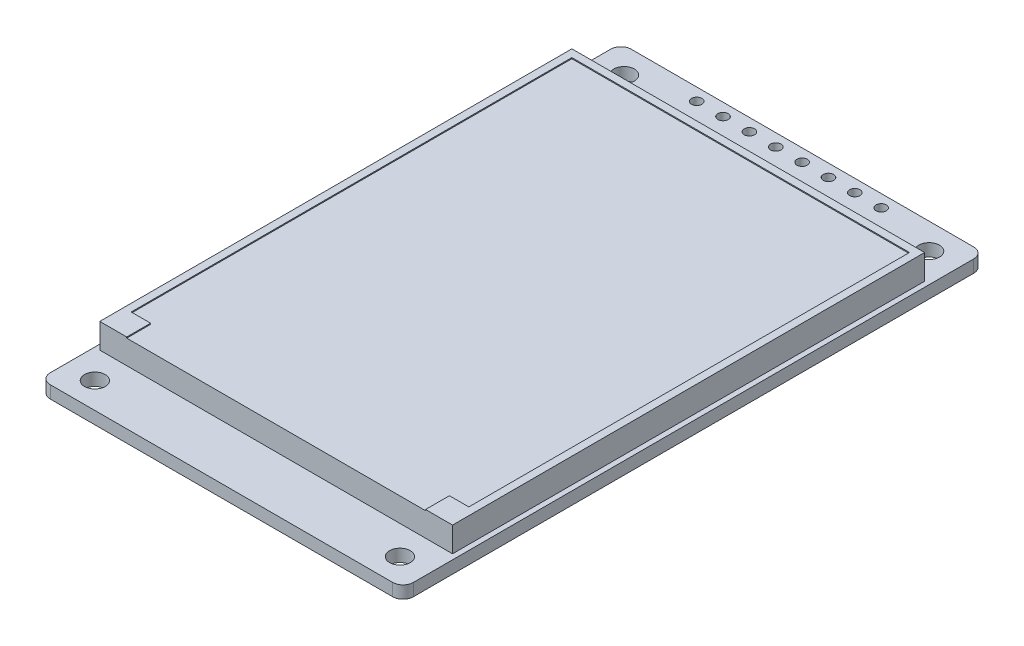
ISO-10303-21;
HEADER;
FILE_DESCRIPTION(('STEP AP214'),'2;1');
FILE_NAME('part.step','',(''),(''),'','','');
FILE_SCHEMA(('AUTOMOTIVE_DESIGN { 1 0 10303 214 1 1 1 1 }'));
ENDSEC;
DATA;
#1=APPLICATION_CONTEXT('core data for automotive mechanical design processes');
#2=APPLICATION_PROTOCOL_DEFINITION('international standard','automotive_design',2000,#1);
#3=PRODUCT_CONTEXT('',#1,'mechanical');
#4=PRODUCT('Part','Part','',(#3));
#5=PRODUCT_RELATED_PRODUCT_CATEGORY('part','',(#4));
#6=PRODUCT_DEFINITION_FORMATION('','',#4);
#7=PRODUCT_DEFINITION_CONTEXT('part definition',#1,'design');
#8=PRODUCT_DEFINITION('design','',#6,#7);
#9=PRODUCT_DEFINITION_SHAPE('','',#8);
#10=(LENGTH_UNIT() NAMED_UNIT(*) SI_UNIT(.MILLI.,.METRE.));
#11=(NAMED_UNIT(*) PLANE_ANGLE_UNIT() SI_UNIT($,.RADIAN.));
#12=(NAMED_UNIT(*) SI_UNIT($,.STERADIAN.) SOLID_ANGLE_UNIT());
#13=UNCERTAINTY_MEASURE_WITH_UNIT(LENGTH_MEASURE(1.E-05),#10,'distance_accuracy_value','');
#14=(GEOMETRIC_REPRESENTATION_CONTEXT(3) GLOBAL_UNCERTAINTY_ASSIGNED_CONTEXT((#13)) GLOBAL_UNIT_ASSIGNED_CONTEXT((#10,
#11,#12)) REPRESENTATION_CONTEXT('',''));
#15=CARTESIAN_POINT('',(0.,0.,0.));
#16=DIRECTION('',(0.,0.,1.));
#17=DIRECTION('',(1.,0.,0.));
#18=AXIS2_PLACEMENT_3D('',#15,#16,#17);
#19=CARTESIAN_POINT('',(0.,1.2,0.));
#20=DIRECTION('',(0.,-1.,0.));
#21=DIRECTION('',(0.,0.,-1.));
#22=AXIS2_PLACEMENT_3D('',#19,#20,#21);
#23=PLANE('',#22);
#24=CARTESIAN_POINT('',(8.78,1.2,-26.8));
#25=DIRECTION('',(0.,1.,0.));
#26=DIRECTION('',(0.,0.,1.));
#27=AXIS2_PLACEMENT_3D('',#24,#25,#26);
#28=CIRCLE('',#27,0.500000000000001);
#29=CARTESIAN_POINT('',(8.78,1.2,-26.3));
#30=VERTEX_POINT('',#29);
#31=EDGE_CURVE('E314',#30,#30,#28,.T.);
#32=ORIENTED_EDGE('',*,*,#31,.F.);
#33=EDGE_LOOP('',(#32));
#34=FACE_BOUND('',#33,.T.);
#35=CARTESIAN_POINT('',(6.24,1.2,-26.8));
#36=DIRECTION('',(0.,1.,0.));
#37=DIRECTION('',(0.,0.,1.));
#38=AXIS2_PLACEMENT_3D('',#35,#36,#37);
#39=CIRCLE('',#38,0.500000000000001);
#40=CARTESIAN_POINT('',(6.24,1.2,-26.3));
#41=VERTEX_POINT('',#40);
#42=EDGE_CURVE('E322',#41,#41,#39,.T.);
#43=ORIENTED_EDGE('',*,*,#42,.F.);
#44=EDGE_LOOP('',(#43));
#45=FACE_BOUND('',#44,.T.);
#46=CARTESIAN_POINT('',(3.7,1.2,-26.8));
#47=DIRECTION('',(0.,1.,0.));
#48=DIRECTION('',(0.,0.,1.));
#49=AXIS2_PLACEMENT_3D('',#46,#47,#48);
#50=CIRCLE('',#49,0.500000000000001);
#51=CARTESIAN_POINT('',(3.7,1.2,-26.3));
#52=VERTEX_POINT('',#51);
#53=EDGE_CURVE('E330',#52,#52,#50,.T.);
#54=ORIENTED_EDGE('',*,*,#53,.F.);
#55=EDGE_LOOP('',(#54));
#56=FACE_BOUND('',#55,.T.);
#57=CARTESIAN_POINT('',(1.16,1.2,-26.8));
#58=DIRECTION('',(0.,1.,0.));
#59=DIRECTION('',(0.,0.,1.));
#60=AXIS2_PLACEMENT_3D('',#57,#58,#59);
#61=CIRCLE('',#60,0.500000000000001);
#62=CARTESIAN_POINT('',(1.16,1.2,-26.3));
#63=VERTEX_POINT('',#62);
#64=EDGE_CURVE('E338',#63,#63,#61,.T.);
#65=ORIENTED_EDGE('',*,*,#64,.F.);
#66=EDGE_LOOP('',(#65));
#67=FACE_BOUND('',#66,.T.);
#68=CARTESIAN_POINT('',(-1.38,1.2,-26.8));
#69=DIRECTION('',(0.,1.,0.));
#70=DIRECTION('',(0.,0.,1.));
#71=AXIS2_PLACEMENT_3D('',#68,#69,#70);
#72=CIRCLE('',#71,0.500000000000001);
#73=CARTESIAN_POINT('',(-1.38,1.2,-26.3));
#74=VERTEX_POINT('',#73);
#75=EDGE_CURVE('E346',#74,#74,#72,.T.);
#76=ORIENTED_EDGE('',*,*,#75,.F.);
#77=EDGE_LOOP('',(#76));
#78=FACE_BOUND('',#77,.T.);
#79=CARTESIAN_POINT('',(-3.92,1.2,-26.8));
#80=DIRECTION('',(0.,1.,0.));
#81=DIRECTION('',(0.,0.,1.));
#82=AXIS2_PLACEMENT_3D('',#79,#80,#81);
#83=CIRCLE('',#82,0.500000000000001);
#84=CARTESIAN_POINT('',(-3.92,1.2,-26.3));
#85=VERTEX_POINT('',#84);
#86=EDGE_CURVE('E354',#85,#85,#83,.T.);
#87=ORIENTED_EDGE('',*,*,#86,.F.);
#88=EDGE_LOOP('',(#87));
#89=FACE_BOUND('',#88,.T.);
#90=CARTESIAN_POINT('',(-6.46,1.2,-26.8));
#91=DIRECTION('',(0.,1.,0.));
#92=DIRECTION('',(0.,0.,1.));
#93=AXIS2_PLACEMENT_3D('',#90,#91,#92);
#94=CIRCLE('',#93,0.500000000000001);
#95=CARTESIAN_POINT('',(-6.46,1.2,-26.3));
#96=VERTEX_POINT('',#95);
#97=EDGE_CURVE('E362',#96,#96,#94,.T.);
#98=ORIENTED_EDGE('',*,*,#97,.F.);
#99=EDGE_LOOP('',(#98));
#100=FACE_BOUND('',#99,.T.);
#101=CARTESIAN_POINT('',(-9.00000000000001,1.2,-26.8));
#102=DIRECTION('',(0.,1.,0.));
#103=DIRECTION('',(0.,0.,1.));
#104=AXIS2_PLACEMENT_3D('',#101,#102,#103);
#105=CIRCLE('',#104,0.500000000000001);
#106=CARTESIAN_POINT('',(-9.00000000000001,1.2,-26.3));
#107=VERTEX_POINT('',#106);
#108=EDGE_CURVE('E370',#107,#107,#105,.T.);
#109=ORIENTED_EDGE('',*,*,#108,.F.);
#110=EDGE_LOOP('',(#109));
#111=FACE_BOUND('',#110,.T.);
#112=CARTESIAN_POINT('',(14.7,1.2,25.5));
#113=DIRECTION('',(0.,1.,0.));
#114=DIRECTION('',(0.,0.,1.));
#115=AXIS2_PLACEMENT_3D('',#112,#113,#114);
#116=CIRCLE('',#115,1.);
#117=CARTESIAN_POINT('',(14.7,1.2,26.5));
#118=VERTEX_POINT('',#117);
#119=EDGE_CURVE('E378',#118,#118,#116,.T.);
#120=ORIENTED_EDGE('',*,*,#119,.F.);
#121=EDGE_LOOP('',(#120));
#122=FACE_BOUND('',#121,.T.);
#123=CARTESIAN_POINT('',(-14.7,1.2,25.5));
#124=DIRECTION('',(0.,1.,0.));
#125=DIRECTION('',(0.,0.,-1.));
#126=AXIS2_PLACEMENT_3D('',#123,#124,#125);
#127=CIRCLE('',#126,1.);
#128=CARTESIAN_POINT('',(-14.7,1.2,24.5));
#129=VERTEX_POINT('',#128);
#130=EDGE_CURVE('E386',#129,#129,#127,.T.);
#131=ORIENTED_EDGE('',*,*,#130,.F.);
#132=EDGE_LOOP('',(#131));
#133=FACE_BOUND('',#132,.T.);
#134=CARTESIAN_POINT('',(14.7,1.2,-25.5));
#135=DIRECTION('',(0.,1.,0.));
#136=DIRECTION('',(0.,0.,-1.));
#137=AXIS2_PLACEMENT_3D('',#134,#135,#136);
#138=CIRCLE('',#137,1.);
#139=CARTESIAN_POINT('',(14.7,1.2,-26.5));
#140=VERTEX_POINT('',#139);
#141=EDGE_CURVE('E394',#140,#140,#138,.T.);
#142=ORIENTED_EDGE('',*,*,#141,.F.);
#143=EDGE_LOOP('',(#142));
#144=FACE_BOUND('',#143,.T.);
#145=CARTESIAN_POINT('',(-14.7,1.2,-25.5));
#146=DIRECTION('',(0.,1.,0.));
#147=DIRECTION('',(0.,0.,1.));
#148=AXIS2_PLACEMENT_3D('',#145,#146,#147);
#149=CIRCLE('',#148,1.);
#150=CARTESIAN_POINT('',(-14.7,1.2,-24.5));
#151=VERTEX_POINT('',#150);
#152=EDGE_CURVE('E402',#151,#151,#149,.T.);
#153=ORIENTED_EDGE('',*,*,#152,.F.);
#154=EDGE_LOOP('',(#153));
#155=FACE_BOUND('',#154,.T.);
#156=DIRECTION('',(-1.,0.,0.));
#157=VECTOR('',#156,1.);
#158=CARTESIAN_POINT('',(-17.5,1.2,-28.));
#159=LINE('',#158,#157);
#160=CARTESIAN_POINT('',(16.5,1.2,-28.));
#161=VERTEX_POINT('',#160);
#162=CARTESIAN_POINT('',(-16.5,1.2,-28.));
#163=VERTEX_POINT('',#162);
#164=EDGE_CURVE('E414',#161,#163,#159,.T.);
#165=ORIENTED_EDGE('',*,*,#164,.T.);
#166=CARTESIAN_POINT('',(-16.5,1.2,-27.));
#167=DIRECTION('',(0.,-1.,0.));
#168=DIRECTION('',(0.,0.,-1.));
#169=AXIS2_PLACEMENT_3D('',#166,#167,#168);
#170=CIRCLE('',#169,1.);
#171=CARTESIAN_POINT('',(-17.5,1.2,-27.));
#172=VERTEX_POINT('',#171);
#173=EDGE_CURVE('E476',#163,#172,#170,.F.);
#174=ORIENTED_EDGE('',*,*,#173,.T.);
#175=DIRECTION('',(0.,0.,1.));
#176=VECTOR('',#175,1.);
#177=CARTESIAN_POINT('',(-17.5,1.2,28.));
#178=LINE('',#177,#176);
#179=CARTESIAN_POINT('',(-17.5,1.2,27.));
#180=VERTEX_POINT('',#179);
#181=EDGE_CURVE('E419',#172,#180,#178,.T.);
#182=ORIENTED_EDGE('',*,*,#181,.T.);
#183=CARTESIAN_POINT('',(-16.5,1.2,27.));
#184=DIRECTION('',(0.,-1.,0.));
#185=DIRECTION('',(0.,0.,-1.));
#186=AXIS2_PLACEMENT_3D('',#183,#184,#185);
#187=CIRCLE('',#186,1.);
#188=CARTESIAN_POINT('',(-16.5,1.2,28.));
#189=VERTEX_POINT('',#188);
#190=EDGE_CURVE('E470',#180,#189,#187,.F.);
#191=ORIENTED_EDGE('',*,*,#190,.T.);
#192=DIRECTION('',(1.,0.,0.));
#193=VECTOR('',#192,1.);
#194=CARTESIAN_POINT('',(-17.5,1.2,28.));
#195=LINE('',#194,#193);
#196=CARTESIAN_POINT('',(16.5,1.2,28.));
#197=VERTEX_POINT('',#196);
#198=EDGE_CURVE('E423',#189,#197,#195,.T.);
#199=ORIENTED_EDGE('',*,*,#198,.T.);
#200=CARTESIAN_POINT('',(16.5,1.2,27.));
#201=DIRECTION('',(0.,-1.,0.));
#202=DIRECTION('',(0.,0.,-1.));
#203=AXIS2_PLACEMENT_3D('',#200,#201,#202);
#204=CIRCLE('',#203,1.);
#205=CARTESIAN_POINT('',(17.5,1.2,27.));
#206=VERTEX_POINT('',#205);
#207=EDGE_CURVE('E467',#197,#206,#204,.F.);
#208=ORIENTED_EDGE('',*,*,#207,.T.);
#209=DIRECTION('',(0.,0.,-1.));
#210=VECTOR('',#209,1.);
#211=CARTESIAN_POINT('',(17.5,1.2,28.));
#212=LINE('',#211,#210);
#213=CARTESIAN_POINT('',(17.5,1.2,-27.));
#214=VERTEX_POINT('',#213);
#215=EDGE_CURVE('E410',#206,#214,#212,.T.);
#216=ORIENTED_EDGE('',*,*,#215,.T.);
#217=CARTESIAN_POINT('',(16.5,1.2,-27.));
#218=DIRECTION('',(0.,-1.,0.));
#219=DIRECTION('',(0.,0.,-1.));
#220=AXIS2_PLACEMENT_3D('',#217,#218,#219);
#221=CIRCLE('',#220,1.);
#222=EDGE_CURVE('E473',#214,#161,#221,.F.);
#223=ORIENTED_EDGE('',*,*,#222,.T.);
#224=EDGE_LOOP('',(#165,#174,#182,#191,#199,#208,#216,#223));
#225=FACE_BOUND('',#224,.T.);
#226=DIRECTION('',(0.,0.,-1.));
#227=VECTOR('',#226,1.);
#228=CARTESIAN_POINT('',(17.,1.2,22.73));
#229=LINE('',#228,#227);
#230=CARTESIAN_POINT('',(17.,1.2,22.73));
#231=VERTEX_POINT('',#230);
#232=CARTESIAN_POINT('',(17.,1.2,-22.77));
#233=VERTEX_POINT('',#232);
#234=EDGE_CURVE('E65',#231,#233,#229,.T.);
#235=ORIENTED_EDGE('',*,*,#234,.F.);
#236=DIRECTION('',(1.,0.,0.));
#237=VECTOR('',#236,1.);
#238=CARTESIAN_POINT('',(-17.,1.2,22.73));
#239=LINE('',#238,#237);
#240=CARTESIAN_POINT('',(-17.,1.2,22.73));
#241=VERTEX_POINT('',#240);
#242=EDGE_CURVE('E274',#241,#231,#239,.T.);
#243=ORIENTED_EDGE('',*,*,#242,.F.);
#244=DIRECTION('',(0.,0.,1.));
#245=VECTOR('',#244,1.);
#246=CARTESIAN_POINT('',(-17.,1.2,22.73));
#247=LINE('',#246,#245);
#248=CARTESIAN_POINT('',(-17.,1.2,-22.77));
#249=VERTEX_POINT('',#248);
#250=EDGE_CURVE('E292',#249,#241,#247,.T.);
#251=ORIENTED_EDGE('',*,*,#250,.F.);
#252=DIRECTION('',(-1.,0.,0.));
#253=VECTOR('',#252,1.);
#254=CARTESIAN_POINT('',(-17.,1.2,-22.77));
#255=LINE('',#254,#253);
#256=EDGE_CURVE('E288',#233,#249,#255,.T.);
#257=ORIENTED_EDGE('',*,*,#256,.F.);
#258=EDGE_LOOP('',(#235,#243,#251,#257));
#259=FACE_BOUND('',#258,.T.);
#260=ADVANCED_FACE('F41',(#34,#45,#56,#67,#78,#89,#100,#111,#122,#133,#144,#155,#225,#259),#23,.F.);
#261=CARTESIAN_POINT('',(0.,0.,0.));
#262=DIRECTION('',(0.,-1.,0.));
#263=DIRECTION('',(0.,0.,-1.));
#264=AXIS2_PLACEMENT_3D('',#261,#262,#263);
#265=PLANE('',#264);
#266=CARTESIAN_POINT('',(6.24,0.,-26.8));
#267=DIRECTION('',(0.,1.,0.));
#268=DIRECTION('',(0.,0.,1.));
#269=AXIS2_PLACEMENT_3D('',#266,#267,#268);
#270=CIRCLE('',#269,0.500000000000001);
#271=CARTESIAN_POINT('',(6.24,0.,-26.3));
#272=VERTEX_POINT('',#271);
#273=EDGE_CURVE('E318',#272,#272,#270,.T.);
#274=ORIENTED_EDGE('',*,*,#273,.T.);
#275=EDGE_LOOP('',(#274));
#276=FACE_BOUND('',#275,.T.);
#277=CARTESIAN_POINT('',(1.16,0.,-26.8));
#278=DIRECTION('',(0.,1.,0.));
#279=DIRECTION('',(0.,0.,1.));
#280=AXIS2_PLACEMENT_3D('',#277,#278,#279);
#281=CIRCLE('',#280,0.500000000000001);
#282=CARTESIAN_POINT('',(1.16,0.,-26.3));
#283=VERTEX_POINT('',#282);
#284=EDGE_CURVE('E334',#283,#283,#281,.T.);
#285=ORIENTED_EDGE('',*,*,#284,.T.);
#286=EDGE_LOOP('',(#285));
#287=FACE_BOUND('',#286,.T.);
#288=CARTESIAN_POINT('',(-3.92,0.,-26.8));
#289=DIRECTION('',(0.,1.,0.));
#290=DIRECTION('',(0.,0.,1.));
#291=AXIS2_PLACEMENT_3D('',#288,#289,#290);
#292=CIRCLE('',#291,0.500000000000001);
#293=CARTESIAN_POINT('',(-3.92,0.,-26.3));
#294=VERTEX_POINT('',#293);
#295=EDGE_CURVE('E350',#294,#294,#292,.T.);
#296=ORIENTED_EDGE('',*,*,#295,.T.);
#297=EDGE_LOOP('',(#296));
#298=FACE_BOUND('',#297,.T.);
#299=CARTESIAN_POINT('',(-9.00000000000001,0.,-26.8));
#300=DIRECTION('',(0.,1.,0.));
#301=DIRECTION('',(0.,0.,1.));
#302=AXIS2_PLACEMENT_3D('',#299,#300,#301);
#303=CIRCLE('',#302,0.500000000000001);
#304=CARTESIAN_POINT('',(-9.00000000000001,0.,-26.3));
#305=VERTEX_POINT('',#304);
#306=EDGE_CURVE('E366',#305,#305,#303,.T.);
#307=ORIENTED_EDGE('',*,*,#306,.T.);
#308=EDGE_LOOP('',(#307));
#309=FACE_BOUND('',#308,.T.);
#310=CARTESIAN_POINT('',(-14.7,0.,25.5));
#311=DIRECTION('',(0.,1.,0.));
#312=DIRECTION('',(0.,0.,-1.));
#313=AXIS2_PLACEMENT_3D('',#310,#311,#312);
#314=CIRCLE('',#313,1.);
#315=CARTESIAN_POINT('',(-14.7,0.,24.5));
#316=VERTEX_POINT('',#315);
#317=EDGE_CURVE('E382',#316,#316,#314,.T.);
#318=ORIENTED_EDGE('',*,*,#317,.T.);
#319=EDGE_LOOP('',(#318));
#320=FACE_BOUND('',#319,.T.);
#321=CARTESIAN_POINT('',(-14.7,0.,-25.5));
#322=DIRECTION('',(0.,1.,0.));
#323=DIRECTION('',(0.,0.,1.));
#324=AXIS2_PLACEMENT_3D('',#321,#322,#323);
#325=CIRCLE('',#324,1.);
#326=CARTESIAN_POINT('',(-14.7,0.,-24.5));
#327=VERTEX_POINT('',#326);
#328=EDGE_CURVE('E398',#327,#327,#325,.T.);
#329=ORIENTED_EDGE('',*,*,#328,.T.);
#330=EDGE_LOOP('',(#329));
#331=FACE_BOUND('',#330,.T.);
#332=DIRECTION('',(0.,0.,1.));
#333=VECTOR('',#332,1.);
#334=CARTESIAN_POINT('',(-17.5,0.,28.));
#335=LINE('',#334,#333);
#336=CARTESIAN_POINT('',(-17.5,0.,-27.));
#337=VERTEX_POINT('',#336);
#338=CARTESIAN_POINT('',(-17.5,0.,27.));
#339=VERTEX_POINT('',#338);
#340=EDGE_CURVE('E435',#337,#339,#335,.T.);
#341=ORIENTED_EDGE('',*,*,#340,.F.);
#342=CARTESIAN_POINT('',(-16.5,0.,-27.));
#343=DIRECTION('',(0.,-1.,0.));
#344=DIRECTION('',(0.,0.,-1.));
#345=AXIS2_PLACEMENT_3D('',#342,#343,#344);
#346=CIRCLE('',#345,1.);
#347=CARTESIAN_POINT('',(-16.5,0.,-28.));
#348=VERTEX_POINT('',#347);
#349=EDGE_CURVE('E457',#337,#348,#346,.T.);
#350=ORIENTED_EDGE('',*,*,#349,.T.);
#351=DIRECTION('',(-1.,0.,0.));
#352=VECTOR('',#351,1.);
#353=CARTESIAN_POINT('',(-17.5,0.,-28.));
#354=LINE('',#353,#352);
#355=CARTESIAN_POINT('',(16.5,0.,-28.));
#356=VERTEX_POINT('',#355);
#357=EDGE_CURVE('E431',#356,#348,#354,.T.);
#358=ORIENTED_EDGE('',*,*,#357,.F.);
#359=CARTESIAN_POINT('',(16.5,0.,-27.));
#360=DIRECTION('',(0.,-1.,0.));
#361=DIRECTION('',(0.,0.,-1.));
#362=AXIS2_PLACEMENT_3D('',#359,#360,#361);
#363=CIRCLE('',#362,1.);
#364=CARTESIAN_POINT('',(17.5,0.,-27.));
#365=VERTEX_POINT('',#364);
#366=EDGE_CURVE('E454',#356,#365,#363,.T.);
#367=ORIENTED_EDGE('',*,*,#366,.T.);
#368=DIRECTION('',(0.,0.,-1.));
#369=VECTOR('',#368,1.);
#370=CARTESIAN_POINT('',(17.5,0.,28.));
#371=LINE('',#370,#369);
#372=CARTESIAN_POINT('',(17.5,0.,27.));
#373=VERTEX_POINT('',#372);
#374=EDGE_CURVE('E406',#373,#365,#371,.T.);
#375=ORIENTED_EDGE('',*,*,#374,.F.);
#376=CARTESIAN_POINT('',(16.5,0.,27.));
#377=DIRECTION('',(0.,-1.,0.));
#378=DIRECTION('',(0.,0.,-1.));
#379=AXIS2_PLACEMENT_3D('',#376,#377,#378);
#380=CIRCLE('',#379,1.);
#381=CARTESIAN_POINT('',(16.5,0.,28.));
#382=VERTEX_POINT('',#381);
#383=EDGE_CURVE('E448',#373,#382,#380,.T.);
#384=ORIENTED_EDGE('',*,*,#383,.T.);
#385=DIRECTION('',(1.,0.,0.));
#386=VECTOR('',#385,1.);
#387=CARTESIAN_POINT('',(-17.5,0.,28.));
#388=LINE('',#387,#386);
#389=CARTESIAN_POINT('',(-16.5,0.,28.));
#390=VERTEX_POINT('',#389);
#391=EDGE_CURVE('E415',#390,#382,#388,.T.);
#392=ORIENTED_EDGE('',*,*,#391,.F.);
#393=CARTESIAN_POINT('',(-16.5,0.,27.));
#394=DIRECTION('',(0.,-1.,0.));
#395=DIRECTION('',(0.,0.,-1.));
#396=AXIS2_PLACEMENT_3D('',#393,#394,#395);
#397=CIRCLE('',#396,1.);
#398=EDGE_CURVE('E451',#390,#339,#397,.T.);
#399=ORIENTED_EDGE('',*,*,#398,.T.);
#400=EDGE_LOOP('',(#341,#350,#358,#367,#375,#384,#392,#399));
#401=FACE_BOUND('',#400,.T.);
#402=CARTESIAN_POINT('',(14.7,0.,-25.5));
#403=DIRECTION('',(0.,1.,0.));
#404=DIRECTION('',(0.,0.,-1.));
#405=AXIS2_PLACEMENT_3D('',#402,#403,#404);
#406=CIRCLE('',#405,1.);
#407=CARTESIAN_POINT('',(14.7,0.,-26.5));
#408=VERTEX_POINT('',#407);
#409=EDGE_CURVE('E390',#408,#408,#406,.T.);
#410=ORIENTED_EDGE('',*,*,#409,.T.);
#411=EDGE_LOOP('',(#410));
#412=FACE_BOUND('',#411,.T.);
#413=CARTESIAN_POINT('',(14.7,0.,25.5));
#414=DIRECTION('',(0.,1.,0.));
#415=DIRECTION('',(0.,0.,1.));
#416=AXIS2_PLACEMENT_3D('',#413,#414,#415);
#417=CIRCLE('',#416,1.);
#418=CARTESIAN_POINT('',(14.7,0.,26.5));
#419=VERTEX_POINT('',#418);
#420=EDGE_CURVE('E374',#419,#419,#417,.T.);
#421=ORIENTED_EDGE('',*,*,#420,.T.);
#422=EDGE_LOOP('',(#421));
#423=FACE_BOUND('',#422,.T.);
#424=CARTESIAN_POINT('',(-6.46,0.,-26.8));
#425=DIRECTION('',(0.,1.,0.));
#426=DIRECTION('',(0.,0.,1.));
#427=AXIS2_PLACEMENT_3D('',#424,#425,#426);
#428=CIRCLE('',#427,0.500000000000001);
#429=CARTESIAN_POINT('',(-6.46,0.,-26.3));
#430=VERTEX_POINT('',#429);
#431=EDGE_CURVE('E358',#430,#430,#428,.T.);
#432=ORIENTED_EDGE('',*,*,#431,.T.);
#433=EDGE_LOOP('',(#432));
#434=FACE_BOUND('',#433,.T.);
#435=CARTESIAN_POINT('',(-1.38,0.,-26.8));
#436=DIRECTION('',(0.,1.,0.));
#437=DIRECTION('',(0.,0.,1.));
#438=AXIS2_PLACEMENT_3D('',#435,#436,#437);
#439=CIRCLE('',#438,0.500000000000001);
#440=CARTESIAN_POINT('',(-1.38,0.,-26.3));
#441=VERTEX_POINT('',#440);
#442=EDGE_CURVE('E342',#441,#441,#439,.T.);
#443=ORIENTED_EDGE('',*,*,#442,.T.);
#444=EDGE_LOOP('',(#443));
#445=FACE_BOUND('',#444,.T.);
#446=CARTESIAN_POINT('',(3.7,0.,-26.8));
#447=DIRECTION('',(0.,1.,0.));
#448=DIRECTION('',(0.,0.,1.));
#449=AXIS2_PLACEMENT_3D('',#446,#447,#448);
#450=CIRCLE('',#449,0.500000000000001);
#451=CARTESIAN_POINT('',(3.7,0.,-26.3));
#452=VERTEX_POINT('',#451);
#453=EDGE_CURVE('E326',#452,#452,#450,.T.);
#454=ORIENTED_EDGE('',*,*,#453,.T.);
#455=EDGE_LOOP('',(#454));
#456=FACE_BOUND('',#455,.T.);
#457=CARTESIAN_POINT('',(8.78,0.,-26.8));
#458=DIRECTION('',(0.,1.,0.));
#459=DIRECTION('',(0.,0.,1.));
#460=AXIS2_PLACEMENT_3D('',#457,#458,#459);
#461=CIRCLE('',#460,0.500000000000001);
#462=CARTESIAN_POINT('',(8.78,0.,-26.3));
#463=VERTEX_POINT('',#462);
#464=EDGE_CURVE('E313',#463,#463,#461,.T.);
#465=ORIENTED_EDGE('',*,*,#464,.T.);
#466=EDGE_LOOP('',(#465));
#467=FACE_BOUND('',#466,.T.);
#468=ADVANCED_FACE('F504',(#276,#287,#298,#309,#320,#331,#401,#412,#423,#434,#445,#456,#467),
#265,.T.);
#469=CARTESIAN_POINT('',(17.5,1.2,28.));
#470=DIRECTION('',(-1.,0.,0.));
#471=DIRECTION('',(0.,0.,1.));
#472=AXIS2_PLACEMENT_3D('',#469,#470,#471);
#473=PLANE('',#472);
#474=ORIENTED_EDGE('',*,*,#374,.T.);
#475=DIRECTION('',(0.,-1.,0.));
#476=VECTOR('',#475,1.);
#477=CARTESIAN_POINT('',(17.5,1.2,-27.));
#478=LINE('',#477,#476);
#479=EDGE_CURVE('E483',#365,#214,#478,.F.);
#480=ORIENTED_EDGE('',*,*,#479,.T.);
#481=ORIENTED_EDGE('',*,*,#215,.F.);
#482=DIRECTION('',(0.,-1.,0.));
#483=VECTOR('',#482,1.);
#484=CARTESIAN_POINT('',(17.5,1.2,27.));
#485=LINE('',#484,#483);
#486=EDGE_CURVE('E479',#206,#373,#485,.T.);
#487=ORIENTED_EDGE('',*,*,#486,.T.);
#488=EDGE_LOOP('',(#474,#480,#481,#487));
#489=FACE_BOUND('',#488,.T.);
#490=ADVANCED_FACE('F500',(#489),#473,.F.);
#491=CARTESIAN_POINT('',(-17.5,1.2,-28.));
#492=DIRECTION('',(0.,0.,1.));
#493=DIRECTION('',(1.,0.,0.));
#494=AXIS2_PLACEMENT_3D('',#491,#492,#493);
#495=PLANE('',#494);
#496=ORIENTED_EDGE('',*,*,#357,.T.);
#497=DIRECTION('',(0.,-1.,0.));
#498=VECTOR('',#497,1.);
#499=CARTESIAN_POINT('',(-16.5,1.2,-28.));
#500=LINE('',#499,#498);
#501=EDGE_CURVE('E464',#348,#163,#500,.F.);
#502=ORIENTED_EDGE('',*,*,#501,.T.);
#503=ORIENTED_EDGE('',*,*,#164,.F.);
#504=DIRECTION('',(0.,-1.,0.));
#505=VECTOR('',#504,1.);
#506=CARTESIAN_POINT('',(16.5,1.2,-28.));
#507=LINE('',#506,#505);
#508=EDGE_CURVE('E460',#161,#356,#507,.T.);
#509=ORIENTED_EDGE('',*,*,#508,.T.);
#510=EDGE_LOOP('',(#496,#502,#503,#509));
#511=FACE_BOUND('',#510,.T.);
#512=ADVANCED_FACE('F513',(#511),#495,.F.);
#513=CARTESIAN_POINT('',(-17.5,1.2,28.));
#514=DIRECTION('',(1.,0.,0.));
#515=DIRECTION('',(0.,0.,-1.));
#516=AXIS2_PLACEMENT_3D('',#513,#514,#515);
#517=PLANE('',#516);
#518=ORIENTED_EDGE('',*,*,#181,.F.);
#519=DIRECTION('',(0.,-1.,0.));
#520=VECTOR('',#519,1.);
#521=CARTESIAN_POINT('',(-17.5,1.2,-27.));
#522=LINE('',#521,#520);
#523=EDGE_CURVE('E444',#172,#337,#522,.T.);
#524=ORIENTED_EDGE('',*,*,#523,.T.);
#525=ORIENTED_EDGE('',*,*,#340,.T.);
#526=DIRECTION('',(0.,-1.,0.));
#527=VECTOR('',#526,1.);
#528=CARTESIAN_POINT('',(-17.5,1.2,27.));
#529=LINE('',#528,#527);
#530=EDGE_CURVE('E427',#339,#180,#529,.F.);
#531=ORIENTED_EDGE('',*,*,#530,.T.);
#532=EDGE_LOOP('',(#518,#524,#525,#531));
#533=FACE_BOUND('',#532,.T.);
#534=ADVANCED_FACE('F521',(#533),#517,.F.);
#535=CARTESIAN_POINT('',(-17.5,1.2,28.));
#536=DIRECTION('',(0.,0.,-1.));
#537=DIRECTION('',(-1.,0.,0.));
#538=AXIS2_PLACEMENT_3D('',#535,#536,#537);
#539=PLANE('',#538);
#540=ORIENTED_EDGE('',*,*,#198,.F.);
#541=DIRECTION('',(0.,-1.,0.));
#542=VECTOR('',#541,1.);
#543=CARTESIAN_POINT('',(-16.5,1.2,28.));
#544=LINE('',#543,#542);
#545=EDGE_CURVE('E11',#189,#390,#544,.T.);
#546=ORIENTED_EDGE('',*,*,#545,.T.);
#547=ORIENTED_EDGE('',*,*,#391,.T.);
#548=DIRECTION('',(0.,-1.,0.));
#549=VECTOR('',#548,1.);
#550=CARTESIAN_POINT('',(16.5,1.2,28.));
#551=LINE('',#550,#549);
#552=EDGE_CURVE('E50',#382,#197,#551,.F.);
#553=ORIENTED_EDGE('',*,*,#552,.T.);
#554=EDGE_LOOP('',(#540,#546,#547,#553));
#555=FACE_BOUND('',#554,.T.);
#556=ADVANCED_FACE('F489',(#555),#539,.F.);
#557=CARTESIAN_POINT('',(-14.7,1.2,-25.5));
#558=DIRECTION('',(0.,-1.,0.));
#559=DIRECTION('',(0.,0.,-1.));
#560=AXIS2_PLACEMENT_3D('',#557,#558,#559);
#561=CYLINDRICAL_SURFACE('',#560,1.);
#562=ORIENTED_EDGE('',*,*,#152,.T.);
#563=EDGE_LOOP('',(#562));
#564=FACE_BOUND('',#563,.T.);
#565=ORIENTED_EDGE('',*,*,#328,.F.);
#566=EDGE_LOOP('',(#565));
#567=FACE_BOUND('',#566,.T.);
#568=ADVANCED_FACE('F543',(#564,#567),#561,.F.);
#569=CARTESIAN_POINT('',(14.7,1.2,-25.5));
#570=DIRECTION('',(0.,-1.,0.));
#571=DIRECTION('',(0.,0.,-1.));
#572=AXIS2_PLACEMENT_3D('',#569,#570,#571);
#573=CYLINDRICAL_SURFACE('',#572,1.);
#574=ORIENTED_EDGE('',*,*,#141,.T.);
#575=EDGE_LOOP('',(#574));
#576=FACE_BOUND('',#575,.T.);
#577=ORIENTED_EDGE('',*,*,#409,.F.);
#578=EDGE_LOOP('',(#577));
#579=FACE_BOUND('',#578,.T.);
#580=ADVANCED_FACE('F601',(#576,#579),#573,.F.);
#581=CARTESIAN_POINT('',(-14.7,1.2,25.5));
#582=DIRECTION('',(0.,-1.,0.));
#583=DIRECTION('',(0.,0.,-1.));
#584=AXIS2_PLACEMENT_3D('',#581,#582,#583);
#585=CYLINDRICAL_SURFACE('',#584,1.);
#586=ORIENTED_EDGE('',*,*,#130,.T.);
#587=EDGE_LOOP('',(#586));
#588=FACE_BOUND('',#587,.T.);
#589=ORIENTED_EDGE('',*,*,#317,.F.);
#590=EDGE_LOOP('',(#589));
#591=FACE_BOUND('',#590,.T.);
#592=ADVANCED_FACE('F598',(#588,#591),#585,.F.);
#593=CARTESIAN_POINT('',(14.7,1.2,25.5));
#594=DIRECTION('',(0.,-1.,0.));
#595=DIRECTION('',(0.,0.,-1.));
#596=AXIS2_PLACEMENT_3D('',#593,#594,#595);
#597=CYLINDRICAL_SURFACE('',#596,1.);
#598=ORIENTED_EDGE('',*,*,#119,.T.);
#599=EDGE_LOOP('',(#598));
#600=FACE_BOUND('',#599,.T.);
#601=ORIENTED_EDGE('',*,*,#420,.F.);
#602=EDGE_LOOP('',(#601));
#603=FACE_BOUND('',#602,.T.);
#604=ADVANCED_FACE('F594',(#600,#603),#597,.F.);
#605=CARTESIAN_POINT('',(-9.00000000000001,1.2,-26.8));
#606=DIRECTION('',(0.,-1.,0.));
#607=DIRECTION('',(0.,0.,-1.));
#608=AXIS2_PLACEMENT_3D('',#605,#606,#607);
#609=CYLINDRICAL_SURFACE('',#608,0.500000000000001);
#610=ORIENTED_EDGE('',*,*,#108,.T.);
#611=EDGE_LOOP('',(#610));
#612=FACE_BOUND('',#611,.T.);
#613=ORIENTED_EDGE('',*,*,#306,.F.);
#614=EDGE_LOOP('',(#613));
#615=FACE_BOUND('',#614,.T.);
#616=ADVANCED_FACE('F590',(#612,#615),#609,.F.);
#617=CARTESIAN_POINT('',(-6.46,1.2,-26.8));
#618=DIRECTION('',(0.,-1.,0.));
#619=DIRECTION('',(0.,0.,-1.));
#620=AXIS2_PLACEMENT_3D('',#617,#618,#619);
#621=CYLINDRICAL_SURFACE('',#620,0.500000000000001);
#622=ORIENTED_EDGE('',*,*,#97,.T.);
#623=EDGE_LOOP('',(#622));
#624=FACE_BOUND('',#623,.T.);
#625=ORIENTED_EDGE('',*,*,#431,.F.);
#626=EDGE_LOOP('',(#625));
#627=FACE_BOUND('',#626,.T.);
#628=ADVANCED_FACE('F586',(#624,#627),#621,.F.);
#629=CARTESIAN_POINT('',(-3.92,1.2,-26.8));
#630=DIRECTION('',(0.,-1.,0.));
#631=DIRECTION('',(0.,0.,-1.));
#632=AXIS2_PLACEMENT_3D('',#629,#630,#631);
#633=CYLINDRICAL_SURFACE('',#632,0.500000000000001);
#634=ORIENTED_EDGE('',*,*,#86,.T.);
#635=EDGE_LOOP('',(#634));
#636=FACE_BOUND('',#635,.T.);
#637=ORIENTED_EDGE('',*,*,#295,.F.);
#638=EDGE_LOOP('',(#637));
#639=FACE_BOUND('',#638,.T.);
#640=ADVANCED_FACE('F582',(#636,#639),#633,.F.);
#641=CARTESIAN_POINT('',(-1.38,1.2,-26.8));
#642=DIRECTION('',(0.,-1.,0.));
#643=DIRECTION('',(0.,0.,-1.));
#644=AXIS2_PLACEMENT_3D('',#641,#642,#643);
#645=CYLINDRICAL_SURFACE('',#644,0.500000000000001);
#646=ORIENTED_EDGE('',*,*,#75,.T.);
#647=EDGE_LOOP('',(#646));
#648=FACE_BOUND('',#647,.T.);
#649=ORIENTED_EDGE('',*,*,#442,.F.);
#650=EDGE_LOOP('',(#649));
#651=FACE_BOUND('',#650,.T.);
#652=ADVANCED_FACE('F578',(#648,#651),#645,.F.);
#653=CARTESIAN_POINT('',(1.16,1.2,-26.8));
#654=DIRECTION('',(0.,-1.,0.));
#655=DIRECTION('',(0.,0.,-1.));
#656=AXIS2_PLACEMENT_3D('',#653,#654,#655);
#657=CYLINDRICAL_SURFACE('',#656,0.500000000000001);
#658=ORIENTED_EDGE('',*,*,#64,.T.);
#659=EDGE_LOOP('',(#658));
#660=FACE_BOUND('',#659,.T.);
#661=ORIENTED_EDGE('',*,*,#284,.F.);
#662=EDGE_LOOP('',(#661));
#663=FACE_BOUND('',#662,.T.);
#664=ADVANCED_FACE('F574',(#660,#663),#657,.F.);
#665=CARTESIAN_POINT('',(3.7,1.2,-26.8));
#666=DIRECTION('',(0.,-1.,0.));
#667=DIRECTION('',(0.,0.,-1.));
#668=AXIS2_PLACEMENT_3D('',#665,#666,#667);
#669=CYLINDRICAL_SURFACE('',#668,0.500000000000001);
#670=ORIENTED_EDGE('',*,*,#53,.T.);
#671=EDGE_LOOP('',(#670));
#672=FACE_BOUND('',#671,.T.);
#673=ORIENTED_EDGE('',*,*,#453,.F.);
#674=EDGE_LOOP('',(#673));
#675=FACE_BOUND('',#674,.T.);
#676=ADVANCED_FACE('F565',(#672,#675),#669,.F.);
#677=CARTESIAN_POINT('',(6.24,1.2,-26.8));
#678=DIRECTION('',(0.,-1.,0.));
#679=DIRECTION('',(0.,0.,-1.));
#680=AXIS2_PLACEMENT_3D('',#677,#678,#679);
#681=CYLINDRICAL_SURFACE('',#680,0.500000000000001);
#682=ORIENTED_EDGE('',*,*,#42,.T.);
#683=EDGE_LOOP('',(#682));
#684=FACE_BOUND('',#683,.T.);
#685=ORIENTED_EDGE('',*,*,#273,.F.);
#686=EDGE_LOOP('',(#685));
#687=FACE_BOUND('',#686,.T.);
#688=ADVANCED_FACE('F559',(#684,#687),#681,.F.);
#689=CARTESIAN_POINT('',(8.78,1.2,-26.8));
#690=DIRECTION('',(0.,-1.,0.));
#691=DIRECTION('',(0.,0.,-1.));
#692=AXIS2_PLACEMENT_3D('',#689,#690,#691);
#693=CYLINDRICAL_SURFACE('',#692,0.500000000000001);
#694=ORIENTED_EDGE('',*,*,#31,.T.);
#695=EDGE_LOOP('',(#694));
#696=FACE_BOUND('',#695,.T.);
#697=ORIENTED_EDGE('',*,*,#464,.F.);
#698=EDGE_LOOP('',(#697));
#699=FACE_BOUND('',#698,.T.);
#700=ADVANCED_FACE('F555',(#696,#699),#693,.F.);
#701=CARTESIAN_POINT('',(-16.5,1.2,-27.));
#702=DIRECTION('',(0.,-1.,0.));
#703=DIRECTION('',(0.,0.,-1.));
#704=AXIS2_PLACEMENT_3D('',#701,#702,#703);
#705=CYLINDRICAL_SURFACE('',#704,1.);
#706=ORIENTED_EDGE('',*,*,#173,.F.);
#707=ORIENTED_EDGE('',*,*,#501,.F.);
#708=ORIENTED_EDGE('',*,*,#349,.F.);
#709=ORIENTED_EDGE('',*,*,#523,.F.);
#710=EDGE_LOOP('',(#706,#707,#708,#709));
#711=FACE_BOUND('',#710,.T.);
#712=ADVANCED_FACE('F519',(#711),#705,.T.);
#713=CARTESIAN_POINT('',(16.5,1.2,-27.));
#714=DIRECTION('',(0.,-1.,0.));
#715=DIRECTION('',(0.,0.,-1.));
#716=AXIS2_PLACEMENT_3D('',#713,#714,#715);
#717=CYLINDRICAL_SURFACE('',#716,1.);
#718=ORIENTED_EDGE('',*,*,#222,.F.);
#719=ORIENTED_EDGE('',*,*,#479,.F.);
#720=ORIENTED_EDGE('',*,*,#366,.F.);
#721=ORIENTED_EDGE('',*,*,#508,.F.);
#722=EDGE_LOOP('',(#718,#719,#720,#721));
#723=FACE_BOUND('',#722,.T.);
#724=ADVANCED_FACE('F510',(#723),#717,.T.);
#725=CARTESIAN_POINT('',(-16.5,1.2,27.));
#726=DIRECTION('',(0.,-1.,0.));
#727=DIRECTION('',(0.,0.,-1.));
#728=AXIS2_PLACEMENT_3D('',#725,#726,#727);
#729=CYLINDRICAL_SURFACE('',#728,1.);
#730=ORIENTED_EDGE('',*,*,#190,.F.);
#731=ORIENTED_EDGE('',*,*,#530,.F.);
#732=ORIENTED_EDGE('',*,*,#398,.F.);
#733=ORIENTED_EDGE('',*,*,#545,.F.);
#734=EDGE_LOOP('',(#730,#731,#732,#733));
#735=FACE_BOUND('',#734,.T.);
#736=ADVANCED_FACE('F524',(#735),#729,.T.);
#737=CARTESIAN_POINT('',(16.5,1.2,27.));
#738=DIRECTION('',(0.,-1.,0.));
#739=DIRECTION('',(0.,0.,-1.));
#740=AXIS2_PLACEMENT_3D('',#737,#738,#739);
#741=CYLINDRICAL_SURFACE('',#740,1.);
#742=ORIENTED_EDGE('',*,*,#207,.F.);
#743=ORIENTED_EDGE('',*,*,#552,.F.);
#744=ORIENTED_EDGE('',*,*,#383,.F.);
#745=ORIENTED_EDGE('',*,*,#486,.F.);
#746=EDGE_LOOP('',(#742,#743,#744,#745));
#747=FACE_BOUND('',#746,.T.);
#748=ADVANCED_FACE('F43',(#747),#741,.T.);
#749=CARTESIAN_POINT('',(17.,3.6,22.73));
#750=DIRECTION('',(-1.,0.,0.));
#751=DIRECTION('',(0.,0.,1.));
#752=AXIS2_PLACEMENT_3D('',#749,#750,#751);
#753=PLANE('',#752);
#754=ORIENTED_EDGE('',*,*,#234,.T.);
#755=DIRECTION('',(0.,-1.,0.));
#756=VECTOR('',#755,1.);
#757=CARTESIAN_POINT('',(17.,3.6,-22.77));
#758=LINE('',#757,#756);
#759=CARTESIAN_POINT('',(17.,3.6,-22.77));
#760=VERTEX_POINT('',#759);
#761=EDGE_CURVE('E309',#760,#233,#758,.T.);
#762=ORIENTED_EDGE('',*,*,#761,.F.);
#763=DIRECTION('',(0.,0.,-1.));
#764=VECTOR('',#763,1.);
#765=CARTESIAN_POINT('',(17.,3.6,22.73));
#766=LINE('',#765,#764);
#767=CARTESIAN_POINT('',(17.,3.6,22.73));
#768=VERTEX_POINT('',#767);
#769=EDGE_CURVE('E269',#768,#760,#766,.T.);
#770=ORIENTED_EDGE('',*,*,#769,.F.);
#771=DIRECTION('',(0.,-1.,0.));
#772=VECTOR('',#771,1.);
#773=CARTESIAN_POINT('',(17.,3.6,22.73));
#774=LINE('',#773,#772);
#775=EDGE_CURVE('E285',#768,#231,#774,.T.);
#776=ORIENTED_EDGE('',*,*,#775,.T.);
#777=EDGE_LOOP('',(#754,#762,#770,#776));
#778=FACE_BOUND('',#777,.T.);
#779=ADVANCED_FACE('F530',(#778),#753,.F.);
#780=CARTESIAN_POINT('',(-17.,3.6,-22.77));
#781=DIRECTION('',(0.,0.,1.));
#782=DIRECTION('',(1.,0.,0.));
#783=AXIS2_PLACEMENT_3D('',#780,#781,#782);
#784=PLANE('',#783);
#785=ORIENTED_EDGE('',*,*,#256,.T.);
#786=DIRECTION('',(0.,-1.,0.));
#787=VECTOR('',#786,1.);
#788=CARTESIAN_POINT('',(-17.,3.6,-22.77));
#789=LINE('',#788,#787);
#790=CARTESIAN_POINT('',(-17.,3.6,-22.77));
#791=VERTEX_POINT('',#790);
#792=EDGE_CURVE('E305',#791,#249,#789,.T.);
#793=ORIENTED_EDGE('',*,*,#792,.F.);
#794=DIRECTION('',(-1.,0.,0.));
#795=VECTOR('',#794,1.);
#796=CARTESIAN_POINT('',(-17.,3.6,-22.77));
#797=LINE('',#796,#795);
#798=EDGE_CURVE('E273',#760,#791,#797,.T.);
#799=ORIENTED_EDGE('',*,*,#798,.F.);
#800=ORIENTED_EDGE('',*,*,#761,.T.);
#801=EDGE_LOOP('',(#785,#793,#799,#800));
#802=FACE_BOUND('',#801,.T.);
#803=ADVANCED_FACE('F758',(#802),#784,.F.);
#804=CARTESIAN_POINT('',(-17.,3.6,22.73));
#805=DIRECTION('',(1.,0.,0.));
#806=DIRECTION('',(0.,0.,-1.));
#807=AXIS2_PLACEMENT_3D('',#804,#805,#806);
#808=PLANE('',#807);
#809=ORIENTED_EDGE('',*,*,#250,.T.);
#810=DIRECTION('',(0.,-1.,0.));
#811=VECTOR('',#810,1.);
#812=CARTESIAN_POINT('',(-17.,3.6,22.73));
#813=LINE('',#812,#811);
#814=CARTESIAN_POINT('',(-17.,3.6,22.73));
#815=VERTEX_POINT('',#814);
#816=EDGE_CURVE('E301',#815,#241,#813,.T.);
#817=ORIENTED_EDGE('',*,*,#816,.F.);
#818=DIRECTION('',(0.,0.,1.));
#819=VECTOR('',#818,1.);
#820=CARTESIAN_POINT('',(-17.,3.6,22.73));
#821=LINE('',#820,#819);
#822=EDGE_CURVE('E277',#791,#815,#821,.T.);
#823=ORIENTED_EDGE('',*,*,#822,.F.);
#824=ORIENTED_EDGE('',*,*,#792,.T.);
#825=EDGE_LOOP('',(#809,#817,#823,#824));
#826=FACE_BOUND('',#825,.T.);
#827=ADVANCED_FACE('F767',(#826),#808,.F.);
#828=CARTESIAN_POINT('',(-17.,3.6,22.73));
#829=DIRECTION('',(0.,0.,-1.));
#830=DIRECTION('',(-1.,0.,0.));
#831=AXIS2_PLACEMENT_3D('',#828,#829,#830);
#832=PLANE('',#831);
#833=DIRECTION('',(1.,0.,0.));
#834=VECTOR('',#833,1.);
#835=CARTESIAN_POINT('',(-17.,3.6,22.73));
#836=LINE('',#835,#834);
#837=CARTESIAN_POINT('',(14.4,3.6,22.73));
#838=VERTEX_POINT('',#837);
#839=EDGE_CURVE('E280',#838,#768,#836,.T.);
#840=ORIENTED_EDGE('',*,*,#839,.F.);
#841=DIRECTION('',(0.,1.,0.));
#842=VECTOR('',#841,1.);
#843=CARTESIAN_POINT('',(14.4,3.5,22.73));
#844=LINE('',#843,#842);
#845=CARTESIAN_POINT('',(14.4,3.5,22.73));
#846=VERTEX_POINT('',#845);
#847=EDGE_CURVE('E260',#846,#838,#844,.T.);
#848=ORIENTED_EDGE('',*,*,#847,.F.);
#849=DIRECTION('',(1.,0.,0.));
#850=VECTOR('',#849,1.);
#851=CARTESIAN_POINT('',(-14.4,3.5,22.73));
#852=LINE('',#851,#850);
#853=CARTESIAN_POINT('',(-14.4,3.5,22.73));
#854=VERTEX_POINT('',#853);
#855=EDGE_CURVE('E212',#854,#846,#852,.T.);
#856=ORIENTED_EDGE('',*,*,#855,.F.);
#857=DIRECTION('',(0.,1.,0.));
#858=VECTOR('',#857,1.);
#859=CARTESIAN_POINT('',(-14.4,3.5,22.73));
#860=LINE('',#859,#858);
#861=CARTESIAN_POINT('',(-14.4,3.6,22.73));
#862=VERTEX_POINT('',#861);
#863=EDGE_CURVE('E263',#854,#862,#860,.T.);
#864=ORIENTED_EDGE('',*,*,#863,.T.);
#865=EDGE_CURVE('E281',#815,#862,#836,.T.);
#866=ORIENTED_EDGE('',*,*,#865,.F.);
#867=ORIENTED_EDGE('',*,*,#816,.T.);
#868=ORIENTED_EDGE('',*,*,#242,.T.);
#869=ORIENTED_EDGE('',*,*,#775,.F.);
#870=EDGE_LOOP('',(#840,#848,#856,#864,#866,#867,#868,#869));
#871=FACE_BOUND('',#870,.T.);
#872=ADVANCED_FACE('F776',(#871),#832,.F.);
#873=CARTESIAN_POINT('',(0.,3.6,0.));
#874=DIRECTION('',(0.,-1.,0.));
#875=DIRECTION('',(0.,0.,-1.));
#876=AXIS2_PLACEMENT_3D('',#873,#874,#875);
#877=PLANE('',#876);
#878=DIRECTION('',(1.,0.,0.));
#879=VECTOR('',#878,1.);
#880=CARTESIAN_POINT('',(14.4,3.6,20.43));
#881=LINE('',#880,#879);
#882=CARTESIAN_POINT('',(14.4,3.6,20.43));
#883=VERTEX_POINT('',#882);
#884=CARTESIAN_POINT('',(16.27,3.6,20.43));
#885=VERTEX_POINT('',#884);
#886=EDGE_CURVE('E241',#883,#885,#881,.T.);
#887=ORIENTED_EDGE('',*,*,#886,.F.);
#888=DIRECTION('',(0.,0.,-1.));
#889=VECTOR('',#888,1.);
#890=CARTESIAN_POINT('',(14.4,3.6,20.43));
#891=LINE('',#890,#889);
#892=EDGE_CURVE('E237',#838,#883,#891,.T.);
#893=ORIENTED_EDGE('',*,*,#892,.F.);
#894=ORIENTED_EDGE('',*,*,#839,.T.);
#895=ORIENTED_EDGE('',*,*,#769,.T.);
#896=ORIENTED_EDGE('',*,*,#798,.T.);
#897=ORIENTED_EDGE('',*,*,#822,.T.);
#898=ORIENTED_EDGE('',*,*,#865,.T.);
#899=DIRECTION('',(0.,0.,1.));
#900=VECTOR('',#899,1.);
#901=CARTESIAN_POINT('',(-14.4,3.6,20.43));
#902=LINE('',#901,#900);
#903=CARTESIAN_POINT('',(-14.4,3.6,20.43));
#904=VERTEX_POINT('',#903);
#905=EDGE_CURVE('E234',#904,#862,#902,.T.);
#906=ORIENTED_EDGE('',*,*,#905,.F.);
#907=DIRECTION('',(1.,0.,0.));
#908=VECTOR('',#907,1.);
#909=CARTESIAN_POINT('',(-16.27,3.6,20.43));
#910=LINE('',#909,#908);
#911=CARTESIAN_POINT('',(-16.27,3.6,20.43));
#912=VERTEX_POINT('',#911);
#913=EDGE_CURVE('E231',#912,#904,#910,.T.);
#914=ORIENTED_EDGE('',*,*,#913,.F.);
#915=DIRECTION('',(0.,0.,1.));
#916=VECTOR('',#915,1.);
#917=CARTESIAN_POINT('',(-16.27,3.6,-22.04));
#918=LINE('',#917,#916);
#919=CARTESIAN_POINT('',(-16.27,3.6,-22.04));
#920=VERTEX_POINT('',#919);
#921=EDGE_CURVE('E57',#920,#912,#918,.T.);
#922=ORIENTED_EDGE('',*,*,#921,.F.);
#923=DIRECTION('',(-1.,0.,0.));
#924=VECTOR('',#923,1.);
#925=CARTESIAN_POINT('',(-16.27,3.6,-22.04));
#926=LINE('',#925,#924);
#927=CARTESIAN_POINT('',(16.27,3.6,-22.04));
#928=VERTEX_POINT('',#927);
#929=EDGE_CURVE('E203',#928,#920,#926,.T.);
#930=ORIENTED_EDGE('',*,*,#929,.F.);
#931=DIRECTION('',(0.,0.,-1.));
#932=VECTOR('',#931,1.);
#933=CARTESIAN_POINT('',(16.27,3.6,-22.04));
#934=LINE('',#933,#932);
#935=EDGE_CURVE('E207',#885,#928,#934,.T.);
#936=ORIENTED_EDGE('',*,*,#935,.F.);
#937=EDGE_LOOP('',(#887,#893,#894,#895,#896,#897,#898,#906,#914,#922,#930,#936));
#938=FACE_BOUND('',#937,.T.);
#939=ADVANCED_FACE('F786',(#938),#877,.F.);
#940=CARTESIAN_POINT('',(-16.27,3.5,-22.04));
#941=DIRECTION('',(-1.,0.,0.));
#942=DIRECTION('',(0.,0.,1.));
#943=AXIS2_PLACEMENT_3D('',#940,#941,#942);
#944=PLANE('',#943);
#945=ORIENTED_EDGE('',*,*,#921,.T.);
#946=DIRECTION('',(0.,1.,0.));
#947=VECTOR('',#946,1.);
#948=CARTESIAN_POINT('',(-16.27,3.5,20.43));
#949=LINE('',#948,#947);
#950=CARTESIAN_POINT('',(-16.27,3.5,20.43));
#951=VERTEX_POINT('',#950);
#952=EDGE_CURVE('E177',#951,#912,#949,.T.);
#953=ORIENTED_EDGE('',*,*,#952,.F.);
#954=DIRECTION('',(0.,0.,1.));
#955=VECTOR('',#954,1.);
#956=CARTESIAN_POINT('',(-16.27,3.5,-22.04));
#957=LINE('',#956,#955);
#958=CARTESIAN_POINT('',(-16.27,3.5,-22.04));
#959=VERTEX_POINT('',#958);
#960=EDGE_CURVE('E181',#959,#951,#957,.T.);
#961=ORIENTED_EDGE('',*,*,#960,.F.);
#962=DIRECTION('',(0.,1.,0.));
#963=VECTOR('',#962,1.);
#964=CARTESIAN_POINT('',(-16.27,3.5,-22.04));
#965=LINE('',#964,#963);
#966=EDGE_CURVE('E248',#959,#920,#965,.T.);
#967=ORIENTED_EDGE('',*,*,#966,.T.);
#968=EDGE_LOOP('',(#945,#953,#961,#967));
#969=FACE_BOUND('',#968,.T.);
#970=ADVANCED_FACE('F179',(#969),#944,.F.);
#971=CARTESIAN_POINT('',(-16.27,3.5,-22.04));
#972=DIRECTION('',(0.,0.,-1.));
#973=DIRECTION('',(-1.,0.,0.));
#974=AXIS2_PLACEMENT_3D('',#971,#972,#973);
#975=PLANE('',#974);
#976=ORIENTED_EDGE('',*,*,#929,.T.);
#977=ORIENTED_EDGE('',*,*,#966,.F.);
#978=DIRECTION('',(-1.,0.,0.));
#979=VECTOR('',#978,1.);
#980=CARTESIAN_POINT('',(-16.27,3.5,-22.04));
#981=LINE('',#980,#979);
#982=CARTESIAN_POINT('',(16.27,3.5,-22.04));
#983=VERTEX_POINT('',#982);
#984=EDGE_CURVE('E188',#983,#959,#981,.T.);
#985=ORIENTED_EDGE('',*,*,#984,.F.);
#986=DIRECTION('',(0.,1.,0.));
#987=VECTOR('',#986,1.);
#988=CARTESIAN_POINT('',(16.27,3.5,-22.04));
#989=LINE('',#988,#987);
#990=EDGE_CURVE('E251',#983,#928,#989,.T.);
#991=ORIENTED_EDGE('',*,*,#990,.T.);
#992=EDGE_LOOP('',(#976,#977,#985,#991));
#993=FACE_BOUND('',#992,.T.);
#994=ADVANCED_FACE('F805',(#993),#975,.F.);
#995=CARTESIAN_POINT('',(16.27,3.5,-22.04));
#996=DIRECTION('',(1.,0.,0.));
#997=DIRECTION('',(0.,0.,-1.));
#998=AXIS2_PLACEMENT_3D('',#995,#996,#997);
#999=PLANE('',#998);
#1000=ORIENTED_EDGE('',*,*,#935,.T.);
#1001=ORIENTED_EDGE('',*,*,#990,.F.);
#1002=DIRECTION('',(0.,0.,-1.));
#1003=VECTOR('',#1002,1.);
#1004=CARTESIAN_POINT('',(16.27,3.5,-22.04));
#1005=LINE('',#1004,#1003);
#1006=CARTESIAN_POINT('',(16.27,3.5,20.43));
#1007=VERTEX_POINT('',#1006);
#1008=EDGE_CURVE('E224',#1007,#983,#1005,.T.);
#1009=ORIENTED_EDGE('',*,*,#1008,.F.);
#1010=DIRECTION('',(0.,1.,0.));
#1011=VECTOR('',#1010,1.);
#1012=CARTESIAN_POINT('',(16.27,3.5,20.43));
#1013=LINE('',#1012,#1011);
#1014=EDGE_CURVE('E254',#1007,#885,#1013,.T.);
#1015=ORIENTED_EDGE('',*,*,#1014,.T.);
#1016=EDGE_LOOP('',(#1000,#1001,#1009,#1015));
#1017=FACE_BOUND('',#1016,.T.);
#1018=ADVANCED_FACE('F813',(#1017),#999,.F.);
#1019=CARTESIAN_POINT('',(14.4,3.5,20.43));
#1020=DIRECTION('',(0.,0.,1.));
#1021=DIRECTION('',(1.,0.,0.));
#1022=AXIS2_PLACEMENT_3D('',#1019,#1020,#1021);
#1023=PLANE('',#1022);
#1024=ORIENTED_EDGE('',*,*,#886,.T.);
#1025=ORIENTED_EDGE('',*,*,#1014,.F.);
#1026=DIRECTION('',(1.,0.,0.));
#1027=VECTOR('',#1026,1.);
#1028=CARTESIAN_POINT('',(14.4,3.5,20.43));
#1029=LINE('',#1028,#1027);
#1030=CARTESIAN_POINT('',(14.4,3.5,20.43));
#1031=VERTEX_POINT('',#1030);
#1032=EDGE_CURVE('E220',#1031,#1007,#1029,.T.);
#1033=ORIENTED_EDGE('',*,*,#1032,.F.);
#1034=DIRECTION('',(0.,1.,0.));
#1035=VECTOR('',#1034,1.);
#1036=CARTESIAN_POINT('',(14.4,3.5,20.43));
#1037=LINE('',#1036,#1035);
#1038=EDGE_CURVE('E257',#1031,#883,#1037,.T.);
#1039=ORIENTED_EDGE('',*,*,#1038,.T.);
#1040=EDGE_LOOP('',(#1024,#1025,#1033,#1039));
#1041=FACE_BOUND('',#1040,.T.);
#1042=ADVANCED_FACE('F822',(#1041),#1023,.F.);
#1043=CARTESIAN_POINT('',(14.4,3.5,20.43));
#1044=DIRECTION('',(1.,0.,0.));
#1045=DIRECTION('',(0.,0.,-1.));
#1046=AXIS2_PLACEMENT_3D('',#1043,#1044,#1045);
#1047=PLANE('',#1046);
#1048=ORIENTED_EDGE('',*,*,#892,.T.);
#1049=ORIENTED_EDGE('',*,*,#1038,.F.);
#1050=DIRECTION('',(0.,0.,-1.));
#1051=VECTOR('',#1050,1.);
#1052=CARTESIAN_POINT('',(14.4,3.5,20.43));
#1053=LINE('',#1052,#1051);
#1054=EDGE_CURVE('E216',#846,#1031,#1053,.T.);
#1055=ORIENTED_EDGE('',*,*,#1054,.F.);
#1056=ORIENTED_EDGE('',*,*,#847,.T.);
#1057=EDGE_LOOP('',(#1048,#1049,#1055,#1056));
#1058=FACE_BOUND('',#1057,.T.);
#1059=ADVANCED_FACE('F831',(#1058),#1047,.F.);
#1060=CARTESIAN_POINT('',(-14.4,3.5,20.43));
#1061=DIRECTION('',(-1.,0.,0.));
#1062=DIRECTION('',(0.,0.,1.));
#1063=AXIS2_PLACEMENT_3D('',#1060,#1061,#1062);
#1064=PLANE('',#1063);
#1065=ORIENTED_EDGE('',*,*,#905,.T.);
#1066=ORIENTED_EDGE('',*,*,#863,.F.);
#1067=DIRECTION('',(0.,0.,1.));
#1068=VECTOR('',#1067,1.);
#1069=CARTESIAN_POINT('',(-14.4,3.5,20.43));
#1070=LINE('',#1069,#1068);
#1071=CARTESIAN_POINT('',(-14.4,3.5,20.43));
#1072=VERTEX_POINT('',#1071);
#1073=EDGE_CURVE('E197',#1072,#854,#1070,.T.);
#1074=ORIENTED_EDGE('',*,*,#1073,.F.);
#1075=DIRECTION('',(0.,1.,0.));
#1076=VECTOR('',#1075,1.);
#1077=CARTESIAN_POINT('',(-14.4,3.5,20.43));
#1078=LINE('',#1077,#1076);
#1079=EDGE_CURVE('E187',#1072,#904,#1078,.T.);
#1080=ORIENTED_EDGE('',*,*,#1079,.T.);
#1081=EDGE_LOOP('',(#1065,#1066,#1074,#1080));
#1082=FACE_BOUND('',#1081,.T.);
#1083=ADVANCED_FACE('F840',(#1082),#1064,.F.);
#1084=CARTESIAN_POINT('',(-16.27,3.5,20.43));
#1085=DIRECTION('',(0.,0.,1.));
#1086=DIRECTION('',(1.,0.,0.));
#1087=AXIS2_PLACEMENT_3D('',#1084,#1085,#1086);
#1088=PLANE('',#1087);
#1089=ORIENTED_EDGE('',*,*,#913,.T.);
#1090=ORIENTED_EDGE('',*,*,#1079,.F.);
#1091=DIRECTION('',(1.,0.,0.));
#1092=VECTOR('',#1091,1.);
#1093=CARTESIAN_POINT('',(-16.27,3.5,20.43));
#1094=LINE('',#1093,#1092);
#1095=EDGE_CURVE('E191',#951,#1072,#1094,.T.);
#1096=ORIENTED_EDGE('',*,*,#1095,.F.);
#1097=ORIENTED_EDGE('',*,*,#952,.T.);
#1098=EDGE_LOOP('',(#1089,#1090,#1096,#1097));
#1099=FACE_BOUND('',#1098,.T.);
#1100=ADVANCED_FACE('F192',(#1099),#1088,.F.);
#1101=CARTESIAN_POINT('',(0.,3.5,0.));
#1102=DIRECTION('',(0.,1.,0.));
#1103=DIRECTION('',(0.,0.,1.));
#1104=AXIS2_PLACEMENT_3D('',#1101,#1102,#1103);
#1105=PLANE('',#1104);
#1106=ORIENTED_EDGE('',*,*,#960,.T.);
#1107=ORIENTED_EDGE('',*,*,#1095,.T.);
#1108=ORIENTED_EDGE('',*,*,#1073,.T.);
#1109=ORIENTED_EDGE('',*,*,#855,.T.);
#1110=ORIENTED_EDGE('',*,*,#1054,.T.);
#1111=ORIENTED_EDGE('',*,*,#1032,.T.);
#1112=ORIENTED_EDGE('',*,*,#1008,.T.);
#1113=ORIENTED_EDGE('',*,*,#984,.T.);
#1114=EDGE_LOOP('',(#1106,#1107,#1108,#1109,#1110,#1111,#1112,#1113));
#1115=FACE_BOUND('',#1114,.T.);
#1116=ADVANCED_FACE('F199',(#1115),#1105,.T.);
#1117=CLOSED_SHELL('',(#260,#468,#490,#512,#534,#556,#568,#580,#592,#604,#616,#628,#640,#652,
#664,#676,#688,#700,#712,#724,#736,#748,#779,#803,#827,#872,#939,#970,#994,#1018,#1042,#1059,
#1083,#1100,#1116));
#1118=MANIFOLD_SOLID_BREP('B2',#1117);
#1119=ADVANCED_BREP_SHAPE_REPRESENTATION('',(#18,#1118),#14);
#1120=SHAPE_DEFINITION_REPRESENTATION(#9,#1119);
ENDSEC;
END-ISO-10303-21;
